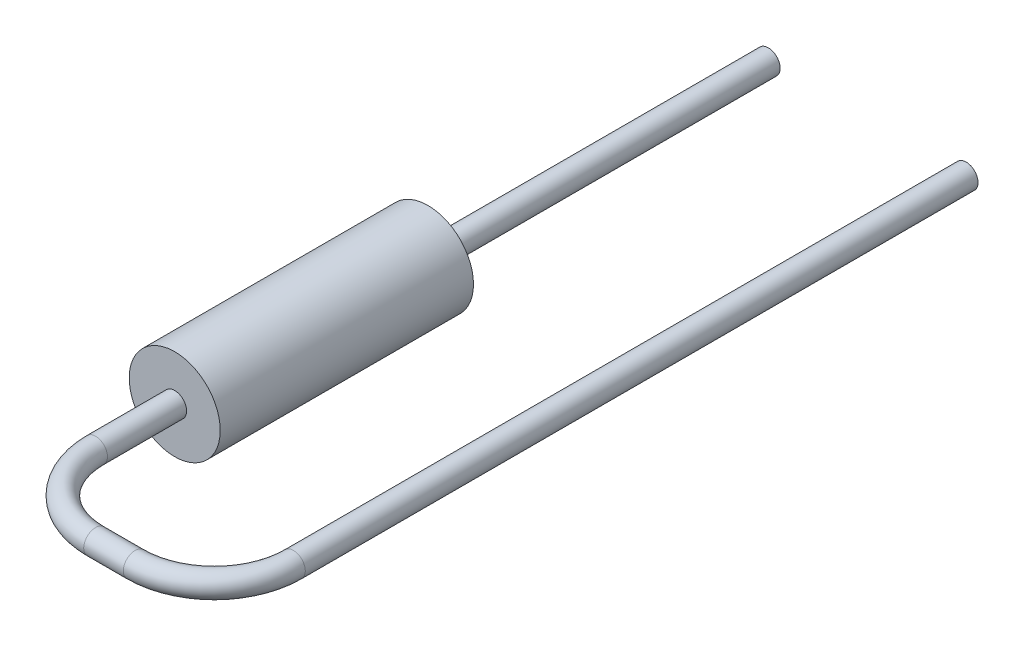
ISO-10303-21;
HEADER;
FILE_DESCRIPTION(('STEP AP214'),'2;1');
FILE_NAME('part.step','',(''),(''),'','','');
FILE_SCHEMA(('AUTOMOTIVE_DESIGN { 1 0 10303 214 1 1 1 1 }'));
ENDSEC;
DATA;
#1=APPLICATION_CONTEXT('core data for automotive mechanical design processes');
#2=APPLICATION_PROTOCOL_DEFINITION('international standard','automotive_design',2000,#1);
#3=PRODUCT_CONTEXT('',#1,'mechanical');
#4=PRODUCT('Part','Part','',(#3));
#5=PRODUCT_RELATED_PRODUCT_CATEGORY('part','',(#4));
#6=PRODUCT_DEFINITION_FORMATION('','',#4);
#7=PRODUCT_DEFINITION_CONTEXT('part definition',#1,'design');
#8=PRODUCT_DEFINITION('design','',#6,#7);
#9=PRODUCT_DEFINITION_SHAPE('','',#8);
#10=(LENGTH_UNIT() NAMED_UNIT(*) SI_UNIT(.MILLI.,.METRE.));
#11=(NAMED_UNIT(*) PLANE_ANGLE_UNIT() SI_UNIT($,.RADIAN.));
#12=(NAMED_UNIT(*) SI_UNIT($,.STERADIAN.) SOLID_ANGLE_UNIT());
#13=UNCERTAINTY_MEASURE_WITH_UNIT(LENGTH_MEASURE(1.E-05),#10,'distance_accuracy_value','');
#14=(GEOMETRIC_REPRESENTATION_CONTEXT(3) GLOBAL_UNCERTAINTY_ASSIGNED_CONTEXT((#13)) GLOBAL_UNIT_ASSIGNED_CONTEXT((#10,
#11,#12)) REPRESENTATION_CONTEXT('',''));
#15=CARTESIAN_POINT('',(0.,0.,0.));
#16=DIRECTION('',(0.,0.,1.));
#17=DIRECTION('',(1.,0.,0.));
#18=AXIS2_PLACEMENT_3D('',#15,#16,#17);
#19=CARTESIAN_POINT('',(0.,0.,0.));
#20=DIRECTION('',(0.,0.,1.));
#21=DIRECTION('',(1.,0.,0.));
#22=AXIS2_PLACEMENT_3D('',#19,#20,#21);
#23=PLANE('',#22);
#24=CARTESIAN_POINT('',(0.,0.,0.));
#25=DIRECTION('',(0.,0.,1.));
#26=DIRECTION('',(1.,0.,0.));
#27=AXIS2_PLACEMENT_3D('',#24,#25,#26);
#28=CIRCLE('',#27,1.15);
#29=CARTESIAN_POINT('',(1.15,0.,0.));
#30=VERTEX_POINT('',#29);
#31=EDGE_CURVE('E47',#30,#30,#28,.T.);
#32=ORIENTED_EDGE('',*,*,#31,.F.);
#33=EDGE_LOOP('',(#32));
#34=FACE_BOUND('',#33,.T.);
#35=CARTESIAN_POINT('',(0.,0.,0.));
#36=DIRECTION('',(0.,0.,1.));
#37=DIRECTION('',(1.,0.,0.));
#38=AXIS2_PLACEMENT_3D('',#35,#36,#37);
#39=CIRCLE('',#38,0.3);
#40=CARTESIAN_POINT('',(0.3,0.,0.));
#41=VERTEX_POINT('',#40);
#42=EDGE_CURVE('E10',#41,#41,#39,.F.);
#43=ORIENTED_EDGE('',*,*,#42,.F.);
#44=EDGE_LOOP('',(#43));
#45=FACE_BOUND('',#44,.T.);
#46=ADVANCED_FACE('F31',(#34,#45),#23,.F.);
#47=CARTESIAN_POINT('',(0.,0.,6.4));
#48=DIRECTION('',(0.,0.,-1.));
#49=DIRECTION('',(-1.,0.,0.));
#50=AXIS2_PLACEMENT_3D('',#47,#48,#49);
#51=CYLINDRICAL_SURFACE('',#50,1.15);
#52=CARTESIAN_POINT('',(0.,0.,6.4));
#53=DIRECTION('',(0.,0.,1.));
#54=DIRECTION('',(1.,0.,0.));
#55=AXIS2_PLACEMENT_3D('',#52,#53,#54);
#56=CIRCLE('',#55,1.15);
#57=CARTESIAN_POINT('',(1.15,0.,6.4));
#58=VERTEX_POINT('',#57);
#59=EDGE_CURVE('E42',#58,#58,#56,.T.);
#60=ORIENTED_EDGE('',*,*,#59,.F.);
#61=EDGE_LOOP('',(#60));
#62=FACE_BOUND('',#61,.T.);
#63=ORIENTED_EDGE('',*,*,#31,.T.);
#64=EDGE_LOOP('',(#63));
#65=FACE_BOUND('',#64,.T.);
#66=ADVANCED_FACE('F33',(#62,#65),#51,.T.);
#67=CARTESIAN_POINT('',(0.,0.,6.4));
#68=DIRECTION('',(0.,0.,1.));
#69=DIRECTION('',(1.,0.,0.));
#70=AXIS2_PLACEMENT_3D('',#67,#68,#69);
#71=PLANE('',#70);
#72=CARTESIAN_POINT('',(0.,0.,6.4));
#73=DIRECTION('',(0.,0.,1.));
#74=DIRECTION('',(1.,0.,0.));
#75=AXIS2_PLACEMENT_3D('',#72,#73,#74);
#76=CIRCLE('',#75,0.3);
#77=CARTESIAN_POINT('',(0.3,0.,6.4));
#78=VERTEX_POINT('',#77);
#79=EDGE_CURVE('E38',#78,#78,#76,.T.);
#80=ORIENTED_EDGE('',*,*,#79,.F.);
#81=EDGE_LOOP('',(#80));
#82=FACE_BOUND('',#81,.T.);
#83=ORIENTED_EDGE('',*,*,#59,.T.);
#84=EDGE_LOOP('',(#83));
#85=FACE_BOUND('',#84,.T.);
#86=ADVANCED_FACE('F73',(#82,#85),#71,.T.);
#87=CARTESIAN_POINT('',(5.,0.,8.4));
#88=DIRECTION('',(0.,0.,-1.));
#89=DIRECTION('',(-1.,0.,0.));
#90=AXIS2_PLACEMENT_3D('',#87,#88,#89);
#91=CYLINDRICAL_SURFACE('',#90,0.3);
#92=CARTESIAN_POINT('',(5.,0.,8.4));
#93=DIRECTION('',(0.,0.,-1.));
#94=DIRECTION('',(-1.,0.,0.));
#95=AXIS2_PLACEMENT_3D('',#92,#93,#94);
#96=CIRCLE('',#95,0.3);
#97=CARTESIAN_POINT('',(5.3,0.,8.4));
#98=VERTEX_POINT('',#97);
#99=EDGE_CURVE('E59',#98,#98,#96,.T.);
#100=ORIENTED_EDGE('',*,*,#99,.T.);
#101=EDGE_LOOP('',(#100));
#102=FACE_BOUND('',#101,.T.);
#103=CARTESIAN_POINT('',(4.99999999999999,0.,-8.6));
#104=DIRECTION('',(0.,0.,-1.));
#105=DIRECTION('',(-1.,0.,0.));
#106=AXIS2_PLACEMENT_3D('',#103,#104,#105);
#107=CIRCLE('',#106,0.3);
#108=CARTESIAN_POINT('',(4.69999999999999,0.,-8.6));
#109=VERTEX_POINT('',#108);
#110=EDGE_CURVE('E62',#109,#109,#107,.T.);
#111=ORIENTED_EDGE('',*,*,#110,.F.);
#112=EDGE_LOOP('',(#111));
#113=FACE_BOUND('',#112,.T.);
#114=ADVANCED_FACE('F78',(#102,#113),#91,.T.);
#115=CARTESIAN_POINT('',(3.,0.,8.4));
#116=DIRECTION('',(0.,1.,0.));
#117=DIRECTION('',(0.,0.,1.));
#118=AXIS2_PLACEMENT_3D('',#115,#116,#117);
#119=TOROIDAL_SURFACE('',#118,2.,0.3);
#120=CARTESIAN_POINT('',(3.,0.,10.4));
#121=DIRECTION('',(1.,0.,0.));
#122=DIRECTION('',(0.,0.,-1.));
#123=AXIS2_PLACEMENT_3D('',#120,#121,#122);
#124=CIRCLE('',#123,0.3);
#125=CARTESIAN_POINT('',(3.,0.,10.7));
#126=VERTEX_POINT('',#125);
#127=EDGE_CURVE('E56',#126,#126,#124,.T.);
#128=CARTESIAN_POINT('',(3.,0.,8.4));
#129=DIRECTION('',(0.,1.,0.));
#130=DIRECTION('',(0.,0.,1.));
#131=AXIS2_PLACEMENT_3D('',#128,#129,#130);
#132=CIRCLE('',#131,2.3);
#133=EDGE_CURVE('',#126,#98,#132,.T.);
#134=ORIENTED_EDGE('',*,*,#127,.T.);
#135=ORIENTED_EDGE('',*,*,#99,.F.);
#136=ORIENTED_EDGE('',*,*,#133,.T.);
#137=ORIENTED_EDGE('',*,*,#133,.F.);
#138=EDGE_LOOP('',(#134,#136,#135,#137));
#139=FACE_BOUND('',#138,.T.);
#140=ADVANCED_FACE('F82',(#139),#119,.T.);
#141=CARTESIAN_POINT('',(2.,0.,10.4));
#142=DIRECTION('',(1.,0.,0.));
#143=DIRECTION('',(0.,0.,-1.));
#144=AXIS2_PLACEMENT_3D('',#141,#142,#143);
#145=CYLINDRICAL_SURFACE('',#144,0.3);
#146=CARTESIAN_POINT('',(2.,0.,10.4));
#147=DIRECTION('',(1.,0.,0.));
#148=DIRECTION('',(0.,0.,-1.));
#149=AXIS2_PLACEMENT_3D('',#146,#147,#148);
#150=CIRCLE('',#149,0.3);
#151=CARTESIAN_POINT('',(2.,0.,10.7));
#152=VERTEX_POINT('',#151);
#153=EDGE_CURVE('E53',#152,#152,#150,.T.);
#154=ORIENTED_EDGE('',*,*,#153,.T.);
#155=EDGE_LOOP('',(#154));
#156=FACE_BOUND('',#155,.T.);
#157=ORIENTED_EDGE('',*,*,#127,.F.);
#158=EDGE_LOOP('',(#157));
#159=FACE_BOUND('',#158,.T.);
#160=ADVANCED_FACE('F86',(#156,#159),#145,.T.);
#161=CARTESIAN_POINT('',(2.,0.,8.4));
#162=DIRECTION('',(0.,1.,0.));
#163=DIRECTION('',(0.,0.,1.));
#164=AXIS2_PLACEMENT_3D('',#161,#162,#163);
#165=TOROIDAL_SURFACE('',#164,2.,0.3);
#166=CARTESIAN_POINT('',(0.,0.,8.4));
#167=DIRECTION('',(0.,0.,1.));
#168=DIRECTION('',(1.,0.,0.));
#169=AXIS2_PLACEMENT_3D('',#166,#167,#168);
#170=CIRCLE('',#169,0.3);
#171=CARTESIAN_POINT('',(-0.299999999999999,0.,8.4));
#172=VERTEX_POINT('',#171);
#173=EDGE_CURVE('E51',#172,#172,#170,.T.);
#174=CARTESIAN_POINT('',(2.,0.,8.4));
#175=DIRECTION('',(0.,1.,0.));
#176=DIRECTION('',(0.,0.,1.));
#177=AXIS2_PLACEMENT_3D('',#174,#175,#176);
#178=CIRCLE('',#177,2.3);
#179=EDGE_CURVE('',#172,#152,#178,.T.);
#180=ORIENTED_EDGE('',*,*,#173,.T.);
#181=ORIENTED_EDGE('',*,*,#153,.F.);
#182=ORIENTED_EDGE('',*,*,#179,.T.);
#183=ORIENTED_EDGE('',*,*,#179,.F.);
#184=EDGE_LOOP('',(#180,#182,#181,#183));
#185=FACE_BOUND('',#184,.T.);
#186=ADVANCED_FACE('F90',(#185),#165,.T.);
#187=CARTESIAN_POINT('',(0.,0.,8.4));
#188=DIRECTION('',(0.,0.,-1.));
#189=DIRECTION('',(-1.,0.,0.));
#190=AXIS2_PLACEMENT_3D('',#187,#188,#189);
#191=CYLINDRICAL_SURFACE('',#190,0.3);
#192=ORIENTED_EDGE('',*,*,#173,.F.);
#193=EDGE_LOOP('',(#192));
#194=FACE_BOUND('',#193,.T.);
#195=ORIENTED_EDGE('',*,*,#79,.T.);
#196=EDGE_LOOP('',(#195));
#197=FACE_BOUND('',#196,.T.);
#198=ADVANCED_FACE('F94',(#194,#197),#191,.T.);
#199=CARTESIAN_POINT('',(4.99999999999999,0.,-8.6));
#200=DIRECTION('',(0.,0.,-1.));
#201=DIRECTION('',(-1.,0.,0.));
#202=AXIS2_PLACEMENT_3D('',#199,#200,#201);
#203=PLANE('',#202);
#204=ORIENTED_EDGE('',*,*,#110,.T.);
#205=EDGE_LOOP('',(#204));
#206=FACE_BOUND('',#205,.T.);
#207=ADVANCED_FACE('F98',(#206),#203,.T.);
#208=CARTESIAN_POINT('',(0.,0.,-9.44852813742386));
#209=DIRECTION('',(0.,0.,1.));
#210=DIRECTION('',(1.,0.,0.));
#211=AXIS2_PLACEMENT_3D('',#208,#209,#210);
#212=CYLINDRICAL_SURFACE('',#211,0.3);
#213=ORIENTED_EDGE('',*,*,#42,.T.);
#214=EDGE_LOOP('',(#213));
#215=FACE_BOUND('',#214,.T.);
#216=CARTESIAN_POINT('',(0.,0.,-8.6));
#217=DIRECTION('',(0.,0.,-1.));
#218=DIRECTION('',(-1.,0.,0.));
#219=AXIS2_PLACEMENT_3D('',#216,#217,#218);
#220=CIRCLE('',#219,0.3);
#221=CARTESIAN_POINT('',(-0.3,0.,-8.6));
#222=VERTEX_POINT('',#221);
#223=EDGE_CURVE('E114',#222,#222,#220,.T.);
#224=ORIENTED_EDGE('',*,*,#223,.F.);
#225=EDGE_LOOP('',(#224));
#226=FACE_BOUND('',#225,.T.);
#227=ADVANCED_FACE('F102',(#215,#226),#212,.T.);
#228=CARTESIAN_POINT('',(4.99999999999999,0.,-8.6));
#229=DIRECTION('',(0.,0.,-1.));
#230=DIRECTION('',(-1.,0.,0.));
#231=AXIS2_PLACEMENT_3D('',#228,#229,#230);
#232=PLANE('',#231);
#233=ORIENTED_EDGE('',*,*,#223,.T.);
#234=EDGE_LOOP('',(#233));
#235=FACE_BOUND('',#234,.T.);
#236=ADVANCED_FACE('F104',(#235),#232,.T.);
#237=CLOSED_SHELL('',(#46,#66,#86,#114,#140,#160,#186,#198,#207,#227,#236));
#238=MANIFOLD_SOLID_BREP('B2',#237);
#239=ADVANCED_BREP_SHAPE_REPRESENTATION('',(#18,#238),#14);
#240=SHAPE_DEFINITION_REPRESENTATION(#9,#239);
ENDSEC;
END-ISO-10303-21;
